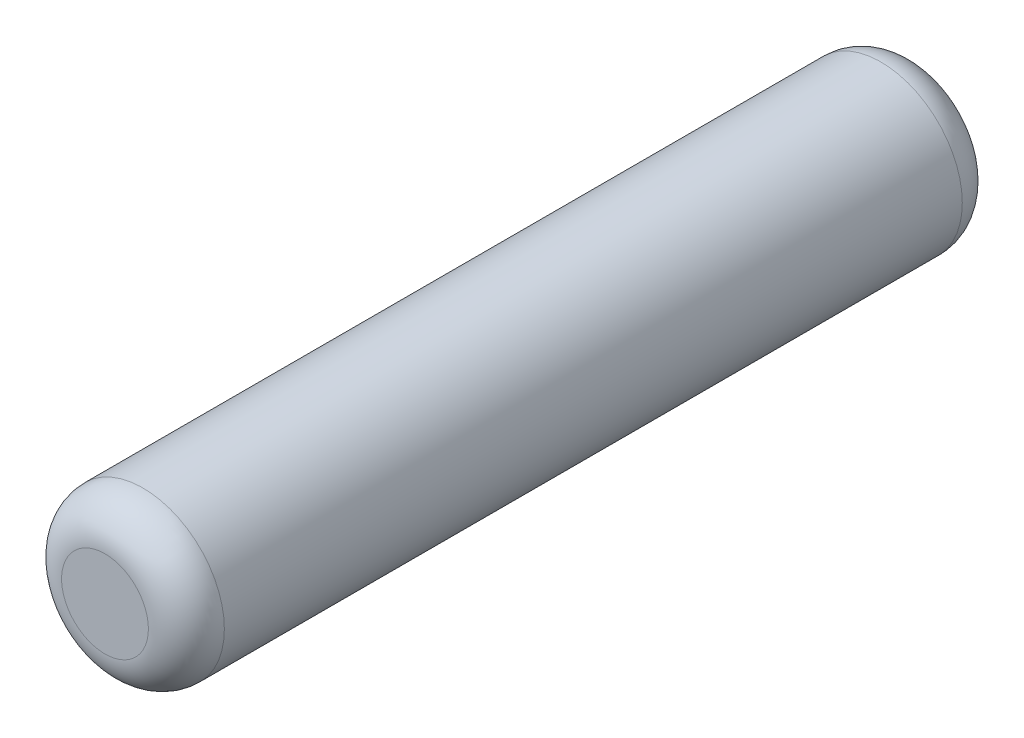
ISO-10303-21;
HEADER;
FILE_DESCRIPTION(('STEP AP214'),'2;1');
FILE_NAME('part.step','',(''),(''),'','','');
FILE_SCHEMA(('AUTOMOTIVE_DESIGN { 1 0 10303 214 1 1 1 1 }'));
ENDSEC;
DATA;
#1=APPLICATION_CONTEXT('core data for automotive mechanical design processes');
#2=APPLICATION_PROTOCOL_DEFINITION('international standard','automotive_design',2000,#1);
#3=PRODUCT_CONTEXT('',#1,'mechanical');
#4=PRODUCT('Part','Part','',(#3));
#5=PRODUCT_RELATED_PRODUCT_CATEGORY('part','',(#4));
#6=PRODUCT_DEFINITION_FORMATION('','',#4);
#7=PRODUCT_DEFINITION_CONTEXT('part definition',#1,'design');
#8=PRODUCT_DEFINITION('design','',#6,#7);
#9=PRODUCT_DEFINITION_SHAPE('','',#8);
#10=(LENGTH_UNIT() NAMED_UNIT(*) SI_UNIT(.MILLI.,.METRE.));
#11=(NAMED_UNIT(*) PLANE_ANGLE_UNIT() SI_UNIT($,.RADIAN.));
#12=(NAMED_UNIT(*) SI_UNIT($,.STERADIAN.) SOLID_ANGLE_UNIT());
#13=UNCERTAINTY_MEASURE_WITH_UNIT(LENGTH_MEASURE(1.E-05),#10,'distance_accuracy_value','');
#14=(GEOMETRIC_REPRESENTATION_CONTEXT(3) GLOBAL_UNCERTAINTY_ASSIGNED_CONTEXT((#13)) GLOBAL_UNIT_ASSIGNED_CONTEXT((#10,
#11,#12)) REPRESENTATION_CONTEXT('',''));
#15=CARTESIAN_POINT('',(0.,0.,0.));
#16=DIRECTION('',(0.,0.,1.));
#17=DIRECTION('',(1.,0.,0.));
#18=AXIS2_PLACEMENT_3D('',#15,#16,#17);
#19=CARTESIAN_POINT('',(0.,0.,3.75));
#20=DIRECTION('',(0.,0.,-1.));
#21=DIRECTION('',(-1.,0.,0.));
#22=AXIS2_PLACEMENT_3D('',#19,#20,#21);
#23=CYLINDRICAL_SURFACE('',#22,0.75);
#24=CARTESIAN_POINT('',(0.,0.,-3.4));
#25=DIRECTION('',(0.,0.,1.));
#26=DIRECTION('',(1.,0.,0.));
#27=AXIS2_PLACEMENT_3D('',#24,#25,#26);
#28=CIRCLE('',#27,0.75);
#29=CARTESIAN_POINT('',(0.75,0.,-3.4));
#30=VERTEX_POINT('',#29);
#31=EDGE_CURVE('E42',#30,#30,#28,.T.);
#32=ORIENTED_EDGE('',*,*,#31,.T.);
#33=EDGE_LOOP('',(#32));
#34=FACE_BOUND('',#33,.T.);
#35=CARTESIAN_POINT('',(0.,0.,3.4));
#36=DIRECTION('',(0.,0.,1.));
#37=DIRECTION('',(1.,0.,0.));
#38=AXIS2_PLACEMENT_3D('',#35,#36,#37);
#39=CIRCLE('',#38,0.75);
#40=CARTESIAN_POINT('',(0.75,0.,3.4));
#41=VERTEX_POINT('',#40);
#42=EDGE_CURVE('E46',#41,#41,#39,.F.);
#43=ORIENTED_EDGE('',*,*,#42,.T.);
#44=EDGE_LOOP('',(#43));
#45=FACE_BOUND('',#44,.T.);
#46=ADVANCED_FACE('F31',(#34,#45),#23,.T.);
#47=CARTESIAN_POINT('',(0.,0.,3.75));
#48=DIRECTION('',(0.,0.,1.));
#49=DIRECTION('',(1.,0.,0.));
#50=AXIS2_PLACEMENT_3D('',#47,#48,#49);
#51=PLANE('',#50);
#52=CARTESIAN_POINT('',(0.,0.,3.75));
#53=DIRECTION('',(0.,0.,1.));
#54=DIRECTION('',(1.,0.,0.));
#55=AXIS2_PLACEMENT_3D('',#52,#53,#54);
#56=CIRCLE('',#55,0.4);
#57=CARTESIAN_POINT('',(0.4,0.,3.75));
#58=VERTEX_POINT('',#57);
#59=EDGE_CURVE('E10',#58,#58,#56,.T.);
#60=ORIENTED_EDGE('',*,*,#59,.T.);
#61=EDGE_LOOP('',(#60));
#62=FACE_BOUND('',#61,.T.);
#63=ADVANCED_FACE('F62',(#62),#51,.T.);
#64=CARTESIAN_POINT('',(0.,0.,-3.75));
#65=DIRECTION('',(0.,0.,1.));
#66=DIRECTION('',(1.,0.,0.));
#67=AXIS2_PLACEMENT_3D('',#64,#65,#66);
#68=PLANE('',#67);
#69=CARTESIAN_POINT('',(0.,0.,-3.75));
#70=DIRECTION('',(0.,0.,1.));
#71=DIRECTION('',(1.,0.,0.));
#72=AXIS2_PLACEMENT_3D('',#69,#70,#71);
#73=CIRCLE('',#72,0.4);
#74=CARTESIAN_POINT('',(0.4,0.,-3.75));
#75=VERTEX_POINT('',#74);
#76=EDGE_CURVE('E38',#75,#75,#73,.F.);
#77=ORIENTED_EDGE('',*,*,#76,.T.);
#78=EDGE_LOOP('',(#77));
#79=FACE_BOUND('',#78,.T.);
#80=ADVANCED_FACE('F59',(#79),#68,.F.);
#81=CARTESIAN_POINT('',(0.,0.,-3.4));
#82=DIRECTION('',(0.,0.,1.));
#83=DIRECTION('',(1.,0.,0.));
#84=AXIS2_PLACEMENT_3D('',#81,#82,#83);
#85=TOROIDAL_SURFACE('',#84,0.4,0.35);
#86=ORIENTED_EDGE('',*,*,#76,.F.);
#87=EDGE_LOOP('',(#86));
#88=FACE_BOUND('',#87,.T.);
#89=ORIENTED_EDGE('',*,*,#31,.F.);
#90=EDGE_LOOP('',(#89));
#91=FACE_BOUND('',#90,.T.);
#92=ADVANCED_FACE('F55',(#88,#91),#85,.T.);
#93=CARTESIAN_POINT('',(0.,0.,3.4));
#94=DIRECTION('',(0.,0.,1.));
#95=DIRECTION('',(1.,0.,0.));
#96=AXIS2_PLACEMENT_3D('',#93,#94,#95);
#97=TOROIDAL_SURFACE('',#96,0.4,0.35);
#98=ORIENTED_EDGE('',*,*,#42,.F.);
#99=EDGE_LOOP('',(#98));
#100=FACE_BOUND('',#99,.T.);
#101=ORIENTED_EDGE('',*,*,#59,.F.);
#102=EDGE_LOOP('',(#101));
#103=FACE_BOUND('',#102,.T.);
#104=ADVANCED_FACE('F33',(#100,#103),#97,.T.);
#105=CLOSED_SHELL('',(#46,#63,#80,#92,#104));
#106=MANIFOLD_SOLID_BREP('B2',#105);
#107=ADVANCED_BREP_SHAPE_REPRESENTATION('',(#18,#106),#14);
#108=SHAPE_DEFINITION_REPRESENTATION(#9,#107);
ENDSEC;
END-ISO-10303-21;
